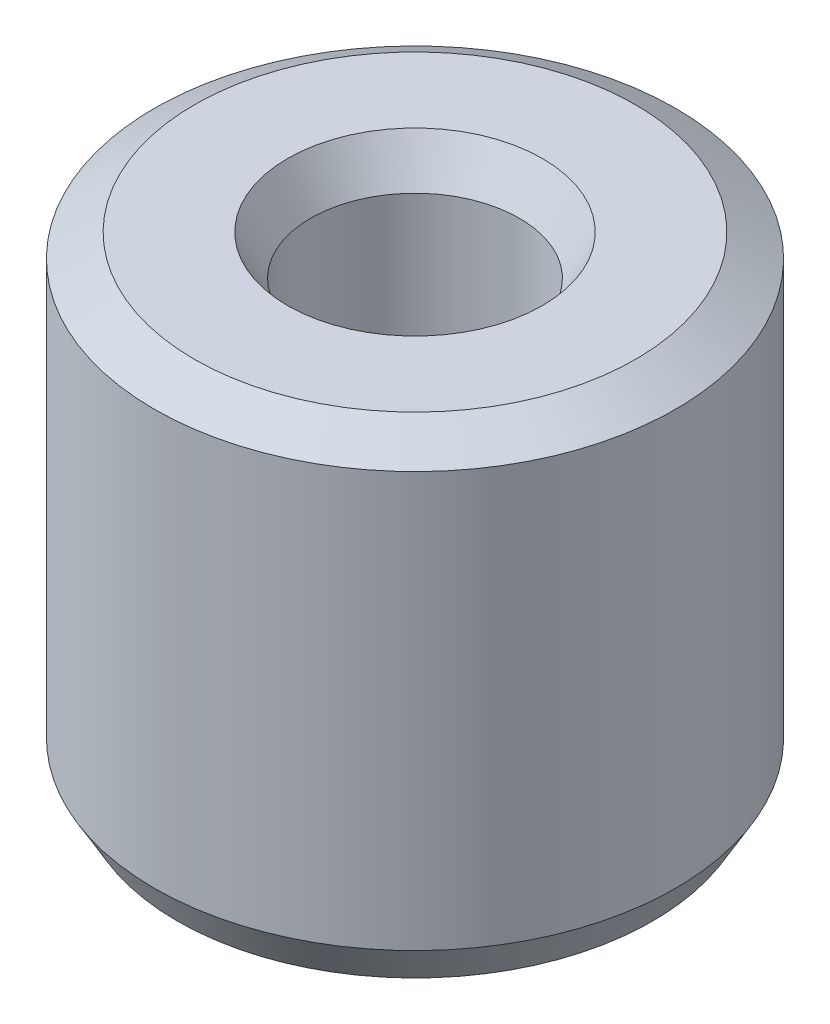
ISO-10303-21;
HEADER;
FILE_DESCRIPTION(('STEP AP214'),'2;1');
FILE_NAME('part.step','',(''),(''),'','','');
FILE_SCHEMA(('AUTOMOTIVE_DESIGN { 1 0 10303 214 1 1 1 1 }'));
ENDSEC;
DATA;
#1=APPLICATION_CONTEXT('core data for automotive mechanical design processes');
#2=APPLICATION_PROTOCOL_DEFINITION('international standard','automotive_design',2000,#1);
#3=PRODUCT_CONTEXT('',#1,'mechanical');
#4=PRODUCT('Part','Part','',(#3));
#5=PRODUCT_RELATED_PRODUCT_CATEGORY('part','',(#4));
#6=PRODUCT_DEFINITION_FORMATION('','',#4);
#7=PRODUCT_DEFINITION_CONTEXT('part definition',#1,'design');
#8=PRODUCT_DEFINITION('design','',#6,#7);
#9=PRODUCT_DEFINITION_SHAPE('','',#8);
#10=(LENGTH_UNIT() NAMED_UNIT(*) SI_UNIT(.MILLI.,.METRE.));
#11=(NAMED_UNIT(*) PLANE_ANGLE_UNIT() SI_UNIT($,.RADIAN.));
#12=(NAMED_UNIT(*) SI_UNIT($,.STERADIAN.) SOLID_ANGLE_UNIT());
#13=UNCERTAINTY_MEASURE_WITH_UNIT(LENGTH_MEASURE(1.E-05),#10,'distance_accuracy_value','');
#14=(GEOMETRIC_REPRESENTATION_CONTEXT(3) GLOBAL_UNCERTAINTY_ASSIGNED_CONTEXT((#13)) GLOBAL_UNIT_ASSIGNED_CONTEXT((#10,
#11,#12)) REPRESENTATION_CONTEXT('',''));
#15=CARTESIAN_POINT('',(0.,0.,0.));
#16=DIRECTION('',(0.,0.,1.));
#17=DIRECTION('',(1.,0.,0.));
#18=AXIS2_PLACEMENT_3D('',#15,#16,#17);
#19=CARTESIAN_POINT('',(0.,59.615822458939,0.));
#20=DIRECTION('',(0.,-1.,0.));
#21=DIRECTION('',(0.,0.,-1.));
#22=AXIS2_PLACEMENT_3D('',#19,#20,#21);
#23=CYLINDRICAL_SURFACE('',#22,32.5);
#24=CARTESIAN_POINT('',(0.,5.0004259756473,0.));
#25=DIRECTION('',(0.,1.,0.));
#26=DIRECTION('',(0.,0.,1.));
#27=AXIS2_PLACEMENT_3D('',#24,#25,#26);
#28=CIRCLE('',#27,32.5);
#29=CARTESIAN_POINT('',(0.,5.0004259756473,32.5));
#30=VERTEX_POINT('',#29);
#31=EDGE_CURVE('E10',#30,#30,#28,.T.);
#32=ORIENTED_EDGE('',*,*,#31,.T.);
#33=EDGE_LOOP('',(#32));
#34=FACE_BOUND('',#33,.T.);
#35=CARTESIAN_POINT('',(0.,56.7288251758362,0.));
#36=DIRECTION('',(0.,1.,0.));
#37=DIRECTION('',(0.,0.,1.));
#38=AXIS2_PLACEMENT_3D('',#35,#36,#37);
#39=CIRCLE('',#38,32.5);
#40=CARTESIAN_POINT('',(0.,56.7288251758362,32.5));
#41=VERTEX_POINT('',#40);
#42=EDGE_CURVE('E50',#41,#41,#39,.F.);
#43=ORIENTED_EDGE('',*,*,#42,.T.);
#44=EDGE_LOOP('',(#43));
#45=FACE_BOUND('',#44,.T.);
#46=ADVANCED_FACE('F39',(#34,#45),#23,.T.);
#47=CARTESIAN_POINT('',(0.,59.615822458939,0.));
#48=DIRECTION('',(0.,1.,0.));
#49=DIRECTION('',(0.,0.,1.));
#50=AXIS2_PLACEMENT_3D('',#47,#48,#49);
#51=PLANE('',#50);
#52=CARTESIAN_POINT('',(0.,59.615822458939,0.));
#53=DIRECTION('',(0.,1.,0.));
#54=DIRECTION('',(0.,0.,1.));
#55=AXIS2_PLACEMENT_3D('',#52,#53,#54);
#56=CIRCLE('',#55,15.8918370577778);
#57=CARTESIAN_POINT('',(0.,59.615822458939,15.8918370577778));
#58=VERTEX_POINT('',#57);
#59=EDGE_CURVE('E58',#58,#58,#56,.F.);
#60=ORIENTED_EDGE('',*,*,#59,.T.);
#61=EDGE_LOOP('',(#60));
#62=FACE_BOUND('',#61,.T.);
#63=CARTESIAN_POINT('',(0.,59.615822458939,0.));
#64=DIRECTION('',(0.,1.,0.));
#65=DIRECTION('',(0.,0.,1.));
#66=AXIS2_PLACEMENT_3D('',#63,#64,#65);
#67=CIRCLE('',#66,27.4995740243527);
#68=CARTESIAN_POINT('',(0.,59.615822458939,27.4995740243527));
#69=VERTEX_POINT('',#68);
#70=EDGE_CURVE('E61',#69,#69,#67,.T.);
#71=ORIENTED_EDGE('',*,*,#70,.T.);
#72=EDGE_LOOP('',(#71));
#73=FACE_BOUND('',#72,.T.);
#74=ADVANCED_FACE('F88',(#62,#73),#51,.T.);
#75=CARTESIAN_POINT('',(0.,0.,0.));
#76=DIRECTION('',(0.,1.,0.));
#77=DIRECTION('',(0.,0.,1.));
#78=AXIS2_PLACEMENT_3D('',#75,#76,#77);
#79=PLANE('',#78);
#80=CARTESIAN_POINT('',(0.,0.,0.));
#81=DIRECTION('',(0.,1.,0.));
#82=DIRECTION('',(0.,0.,1.));
#83=AXIS2_PLACEMENT_3D('',#80,#81,#82);
#84=CIRCLE('',#83,18.0052657503223);
#85=CARTESIAN_POINT('',(0.,0.,18.0052657503223));
#86=VERTEX_POINT('',#85);
#87=EDGE_CURVE('E51',#86,#86,#84,.T.);
#88=ORIENTED_EDGE('',*,*,#87,.T.);
#89=EDGE_LOOP('',(#88));
#90=FACE_BOUND('',#89,.T.);
#91=CARTESIAN_POINT('',(0.,0.,0.));
#92=DIRECTION('',(0.,1.,0.));
#93=DIRECTION('',(0.,0.,1.));
#94=AXIS2_PLACEMENT_3D('',#91,#92,#93);
#95=CIRCLE('',#94,29.6130027168972);
#96=CARTESIAN_POINT('',(0.,0.,29.6130027168972));
#97=VERTEX_POINT('',#96);
#98=EDGE_CURVE('E54',#97,#97,#95,.F.);
#99=ORIENTED_EDGE('',*,*,#98,.T.);
#100=EDGE_LOOP('',(#99));
#101=FACE_BOUND('',#100,.T.);
#102=ADVANCED_FACE('F83',(#90,#101),#79,.F.);
#103=CARTESIAN_POINT('',(0.,59.615822458939,0.));
#104=DIRECTION('',(0.,-1.,0.));
#105=DIRECTION('',(0.,0.,-1.));
#106=AXIS2_PLACEMENT_3D('',#103,#104,#105);
#107=CYLINDRICAL_SURFACE('',#106,13.004839774675);
#108=CARTESIAN_POINT('',(0.,54.6153964832917,0.));
#109=DIRECTION('',(0.,1.,0.));
#110=DIRECTION('',(0.,0.,1.));
#111=AXIS2_PLACEMENT_3D('',#108,#109,#110);
#112=CIRCLE('',#111,13.004839774675);
#113=CARTESIAN_POINT('',(0.,54.6153964832917,13.004839774675));
#114=VERTEX_POINT('',#113);
#115=EDGE_CURVE('E67',#114,#114,#112,.T.);
#116=ORIENTED_EDGE('',*,*,#115,.T.);
#117=EDGE_LOOP('',(#116));
#118=FACE_BOUND('',#117,.T.);
#119=CARTESIAN_POINT('',(0.,2.88699728310279,0.));
#120=DIRECTION('',(0.,1.,0.));
#121=DIRECTION('',(0.,0.,1.));
#122=AXIS2_PLACEMENT_3D('',#119,#120,#121);
#123=CIRCLE('',#122,13.004839774675);
#124=CARTESIAN_POINT('',(0.,2.88699728310279,13.004839774675));
#125=VERTEX_POINT('',#124);
#126=EDGE_CURVE('E69',#125,#125,#123,.F.);
#127=ORIENTED_EDGE('',*,*,#126,.T.);
#128=EDGE_LOOP('',(#127));
#129=FACE_BOUND('',#128,.T.);
#130=ADVANCED_FACE('F71',(#118,#129),#107,.F.);
#131=CARTESIAN_POINT('',(0.,54.6153964832917,0.));
#132=DIRECTION('',(0.,1.,0.));
#133=DIRECTION('',(0.,0.,1.));
#134=AXIS2_PLACEMENT_3D('',#131,#132,#133);
#135=CONICAL_SURFACE('',#134,13.004839774675,0.523598775598301);
#136=ORIENTED_EDGE('',*,*,#59,.F.);
#137=EDGE_LOOP('',(#136));
#138=FACE_BOUND('',#137,.T.);
#139=ORIENTED_EDGE('',*,*,#115,.F.);
#140=EDGE_LOOP('',(#139));
#141=FACE_BOUND('',#140,.T.);
#142=ADVANCED_FACE('F77',(#138,#141),#135,.F.);
#143=CARTESIAN_POINT('',(0.,0.,0.));
#144=DIRECTION('',(0.,-1.,0.));
#145=DIRECTION('',(0.,0.,-1.));
#146=AXIS2_PLACEMENT_3D('',#143,#144,#145);
#147=CONICAL_SURFACE('',#146,18.0052657503223,1.04719755119659);
#148=ORIENTED_EDGE('',*,*,#126,.F.);
#149=EDGE_LOOP('',(#148));
#150=FACE_BOUND('',#149,.T.);
#151=ORIENTED_EDGE('',*,*,#87,.F.);
#152=EDGE_LOOP('',(#151));
#153=FACE_BOUND('',#152,.T.);
#154=ADVANCED_FACE('F73',(#150,#153),#147,.F.);
#155=CARTESIAN_POINT('',(0.,5.0004259756473,0.));
#156=DIRECTION('',(0.,1.,0.));
#157=DIRECTION('',(0.,0.,1.));
#158=AXIS2_PLACEMENT_3D('',#155,#156,#157);
#159=CONICAL_SURFACE('',#158,32.5,0.523598775598302);
#160=ORIENTED_EDGE('',*,*,#98,.F.);
#161=EDGE_LOOP('',(#160));
#162=FACE_BOUND('',#161,.T.);
#163=ORIENTED_EDGE('',*,*,#31,.F.);
#164=EDGE_LOOP('',(#163));
#165=FACE_BOUND('',#164,.T.);
#166=ADVANCED_FACE('F76',(#162,#165),#159,.T.);
#167=CARTESIAN_POINT('',(0.,59.615822458939,0.));
#168=DIRECTION('',(0.,-1.,0.));
#169=DIRECTION('',(0.,0.,-1.));
#170=AXIS2_PLACEMENT_3D('',#167,#168,#169);
#171=CONICAL_SURFACE('',#170,27.4995740243527,1.0471975511966);
#172=ORIENTED_EDGE('',*,*,#42,.F.);
#173=EDGE_LOOP('',(#172));
#174=FACE_BOUND('',#173,.T.);
#175=ORIENTED_EDGE('',*,*,#70,.F.);
#176=EDGE_LOOP('',(#175));
#177=FACE_BOUND('',#176,.T.);
#178=ADVANCED_FACE('F45',(#174,#177),#171,.T.);
#179=CLOSED_SHELL('',(#46,#74,#102,#130,#142,#154,#166,#178));
#180=MANIFOLD_SOLID_BREP('B2',#179);
#181=ADVANCED_BREP_SHAPE_REPRESENTATION('',(#18,#180),#14);
#182=SHAPE_DEFINITION_REPRESENTATION(#9,#181);
ENDSEC;
END-ISO-10303-21;
